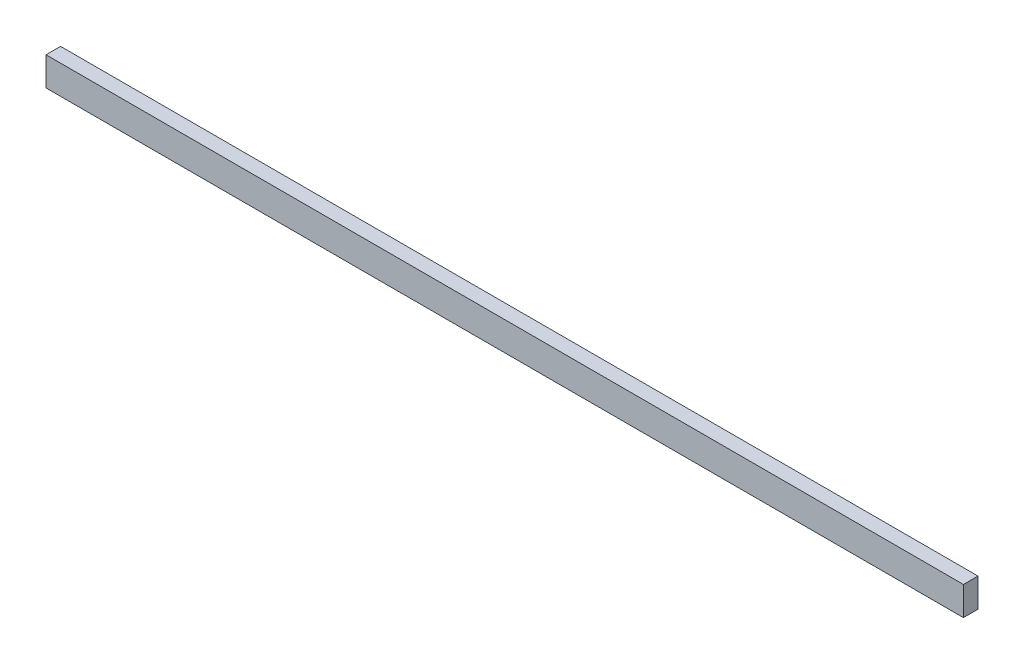
ISO-10303-21;
HEADER;
FILE_DESCRIPTION(('STEP AP214'),'2;1');
FILE_NAME('part.step','',(''),(''),'','','');
FILE_SCHEMA(('AUTOMOTIVE_DESIGN { 1 0 10303 214 1 1 1 1 }'));
ENDSEC;
DATA;
#1=APPLICATION_CONTEXT('core data for automotive mechanical design processes');
#2=APPLICATION_PROTOCOL_DEFINITION('international standard','automotive_design',2000,#1);
#3=PRODUCT_CONTEXT('',#1,'mechanical');
#4=PRODUCT('Part','Part','',(#3));
#5=PRODUCT_RELATED_PRODUCT_CATEGORY('part','',(#4));
#6=PRODUCT_DEFINITION_FORMATION('','',#4);
#7=PRODUCT_DEFINITION_CONTEXT('part definition',#1,'design');
#8=PRODUCT_DEFINITION('design','',#6,#7);
#9=PRODUCT_DEFINITION_SHAPE('','',#8);
#10=(LENGTH_UNIT() NAMED_UNIT(*) SI_UNIT(.MILLI.,.METRE.));
#11=(NAMED_UNIT(*) PLANE_ANGLE_UNIT() SI_UNIT($,.RADIAN.));
#12=(NAMED_UNIT(*) SI_UNIT($,.STERADIAN.) SOLID_ANGLE_UNIT());
#13=UNCERTAINTY_MEASURE_WITH_UNIT(LENGTH_MEASURE(1.E-05),#10,'distance_accuracy_value','');
#14=(GEOMETRIC_REPRESENTATION_CONTEXT(3) GLOBAL_UNCERTAINTY_ASSIGNED_CONTEXT((#13)) GLOBAL_UNIT_ASSIGNED_CONTEXT((#10,
#11,#12)) REPRESENTATION_CONTEXT('',''));
#15=CARTESIAN_POINT('',(0.,0.,0.));
#16=DIRECTION('',(0.,0.,1.));
#17=DIRECTION('',(1.,0.,0.));
#18=AXIS2_PLACEMENT_3D('',#15,#16,#17);
#19=CARTESIAN_POINT('',(190.5,5.969,-3.0226));
#20=DIRECTION('',(0.,0.,1.));
#21=DIRECTION('',(0.,-1.,0.));
#22=AXIS2_PLACEMENT_3D('',#19,#20,#21);
#23=PLANE('',#22);
#24=DIRECTION('',(0.,1.,0.));
#25=VECTOR('',#24,1.);
#26=CARTESIAN_POINT('',(-190.5,5.969,-3.0226));
#27=LINE('',#26,#25);
#28=CARTESIAN_POINT('',(-190.5,-5.969,-3.0226));
#29=VERTEX_POINT('',#28);
#30=CARTESIAN_POINT('',(-190.5,5.969,-3.0226));
#31=VERTEX_POINT('',#30);
#32=EDGE_CURVE('E95',#29,#31,#27,.T.);
#33=ORIENTED_EDGE('',*,*,#32,.T.);
#34=DIRECTION('',(-1.,0.,0.));
#35=VECTOR('',#34,1.);
#36=CARTESIAN_POINT('',(190.5,5.969,-3.0226));
#37=LINE('',#36,#35);
#38=CARTESIAN_POINT('',(190.5,5.969,-3.0226));
#39=VERTEX_POINT('',#38);
#40=EDGE_CURVE('E11',#39,#31,#37,.T.);
#41=ORIENTED_EDGE('',*,*,#40,.F.);
#42=DIRECTION('',(0.,1.,0.));
#43=VECTOR('',#42,1.);
#44=CARTESIAN_POINT('',(190.5,5.969,-3.0226));
#45=LINE('',#44,#43);
#46=CARTESIAN_POINT('',(190.5,-5.969,-3.0226));
#47=VERTEX_POINT('',#46);
#48=EDGE_CURVE('E83',#47,#39,#45,.T.);
#49=ORIENTED_EDGE('',*,*,#48,.F.);
#50=DIRECTION('',(-1.,0.,0.));
#51=VECTOR('',#50,1.);
#52=CARTESIAN_POINT('',(190.5,-5.969,-3.0226));
#53=LINE('',#52,#51);
#54=EDGE_CURVE('E91',#47,#29,#53,.T.);
#55=ORIENTED_EDGE('',*,*,#54,.T.);
#56=EDGE_LOOP('',(#33,#41,#49,#55));
#57=FACE_BOUND('',#56,.T.);
#58=ADVANCED_FACE('F32',(#57),#23,.F.);
#59=CARTESIAN_POINT('',(190.5,5.969,3.0226));
#60=DIRECTION('',(0.,-1.,0.));
#61=DIRECTION('',(0.,0.,-1.));
#62=AXIS2_PLACEMENT_3D('',#59,#60,#61);
#63=PLANE('',#62);
#64=DIRECTION('',(0.,0.,1.));
#65=VECTOR('',#64,1.);
#66=CARTESIAN_POINT('',(-190.5,5.969,3.0226));
#67=LINE('',#66,#65);
#68=CARTESIAN_POINT('',(-190.5,5.969,3.0226));
#69=VERTEX_POINT('',#68);
#70=EDGE_CURVE('E87',#31,#69,#67,.T.);
#71=ORIENTED_EDGE('',*,*,#70,.T.);
#72=DIRECTION('',(-1.,0.,0.));
#73=VECTOR('',#72,1.);
#74=CARTESIAN_POINT('',(190.5,5.969,3.0226));
#75=LINE('',#74,#73);
#76=CARTESIAN_POINT('',(190.5,5.969,3.0226));
#77=VERTEX_POINT('',#76);
#78=EDGE_CURVE('E40',#77,#69,#75,.T.);
#79=ORIENTED_EDGE('',*,*,#78,.F.);
#80=DIRECTION('',(0.,0.,1.));
#81=VECTOR('',#80,1.);
#82=CARTESIAN_POINT('',(190.5,5.969,3.0226));
#83=LINE('',#82,#81);
#84=EDGE_CURVE('E78',#39,#77,#83,.T.);
#85=ORIENTED_EDGE('',*,*,#84,.F.);
#86=ORIENTED_EDGE('',*,*,#40,.T.);
#87=EDGE_LOOP('',(#71,#79,#85,#86));
#88=FACE_BOUND('',#87,.T.);
#89=ADVANCED_FACE('F86',(#88),#63,.F.);
#90=CARTESIAN_POINT('',(190.5,5.969,3.0226));
#91=DIRECTION('',(0.,0.,-1.));
#92=DIRECTION('',(0.,1.,0.));
#93=AXIS2_PLACEMENT_3D('',#90,#91,#92);
#94=PLANE('',#93);
#95=DIRECTION('',(0.,-1.,0.));
#96=VECTOR('',#95,1.);
#97=CARTESIAN_POINT('',(-190.5,5.969,3.0226));
#98=LINE('',#97,#96);
#99=CARTESIAN_POINT('',(-190.5,-5.969,3.0226));
#100=VERTEX_POINT('',#99);
#101=EDGE_CURVE('E65',#69,#100,#98,.T.);
#102=ORIENTED_EDGE('',*,*,#101,.T.);
#103=DIRECTION('',(-1.,0.,0.));
#104=VECTOR('',#103,1.);
#105=CARTESIAN_POINT('',(190.5,-5.969,3.0226));
#106=LINE('',#105,#104);
#107=CARTESIAN_POINT('',(190.5,-5.969,3.0226));
#108=VERTEX_POINT('',#107);
#109=EDGE_CURVE('E88',#108,#100,#106,.T.);
#110=ORIENTED_EDGE('',*,*,#109,.F.);
#111=DIRECTION('',(0.,-1.,0.));
#112=VECTOR('',#111,1.);
#113=CARTESIAN_POINT('',(190.5,5.969,3.0226));
#114=LINE('',#113,#112);
#115=EDGE_CURVE('E81',#77,#108,#114,.T.);
#116=ORIENTED_EDGE('',*,*,#115,.F.);
#117=ORIENTED_EDGE('',*,*,#78,.T.);
#118=EDGE_LOOP('',(#102,#110,#116,#117));
#119=FACE_BOUND('',#118,.T.);
#120=ADVANCED_FACE('F89',(#119),#94,.F.);
#121=CARTESIAN_POINT('',(190.5,-5.969,3.0226));
#122=DIRECTION('',(0.,1.,0.));
#123=DIRECTION('',(0.,0.,1.));
#124=AXIS2_PLACEMENT_3D('',#121,#122,#123);
#125=PLANE('',#124);
#126=DIRECTION('',(0.,0.,-1.));
#127=VECTOR('',#126,1.);
#128=CARTESIAN_POINT('',(-190.5,-5.969,3.0226));
#129=LINE('',#128,#127);
#130=EDGE_CURVE('E71',#100,#29,#129,.T.);
#131=ORIENTED_EDGE('',*,*,#130,.T.);
#132=ORIENTED_EDGE('',*,*,#54,.F.);
#133=DIRECTION('',(0.,0.,-1.));
#134=VECTOR('',#133,1.);
#135=CARTESIAN_POINT('',(190.5,-5.969,3.0226));
#136=LINE('',#135,#134);
#137=EDGE_CURVE('E48',#108,#47,#136,.T.);
#138=ORIENTED_EDGE('',*,*,#137,.F.);
#139=ORIENTED_EDGE('',*,*,#109,.T.);
#140=EDGE_LOOP('',(#131,#132,#138,#139));
#141=FACE_BOUND('',#140,.T.);
#142=ADVANCED_FACE('F102',(#141),#125,.F.);
#143=CARTESIAN_POINT('',(190.5,0.,0.));
#144=DIRECTION('',(1.,0.,0.));
#145=DIRECTION('',(0.,0.,-1.));
#146=AXIS2_PLACEMENT_3D('',#143,#144,#145);
#147=PLANE('',#146);
#148=ORIENTED_EDGE('',*,*,#48,.T.);
#149=ORIENTED_EDGE('',*,*,#84,.T.);
#150=ORIENTED_EDGE('',*,*,#115,.T.);
#151=ORIENTED_EDGE('',*,*,#137,.T.);
#152=EDGE_LOOP('',(#148,#149,#150,#151));
#153=FACE_BOUND('',#152,.T.);
#154=ADVANCED_FACE('F79',(#153),#147,.T.);
#155=CARTESIAN_POINT('',(-190.5,0.,0.));
#156=DIRECTION('',(1.,0.,0.));
#157=DIRECTION('',(0.,0.,-1.));
#158=AXIS2_PLACEMENT_3D('',#155,#156,#157);
#159=PLANE('',#158);
#160=ORIENTED_EDGE('',*,*,#32,.F.);
#161=ORIENTED_EDGE('',*,*,#130,.F.);
#162=ORIENTED_EDGE('',*,*,#101,.F.);
#163=ORIENTED_EDGE('',*,*,#70,.F.);
#164=EDGE_LOOP('',(#160,#161,#162,#163));
#165=FACE_BOUND('',#164,.T.);
#166=ADVANCED_FACE('F105',(#165),#159,.F.);
#167=CLOSED_SHELL('',(#58,#89,#120,#142,#154,#166));
#168=MANIFOLD_SOLID_BREP('B2',#167);
#169=ADVANCED_BREP_SHAPE_REPRESENTATION('',(#18,#168),#14);
#170=SHAPE_DEFINITION_REPRESENTATION(#9,#169);
ENDSEC;
END-ISO-10303-21;
